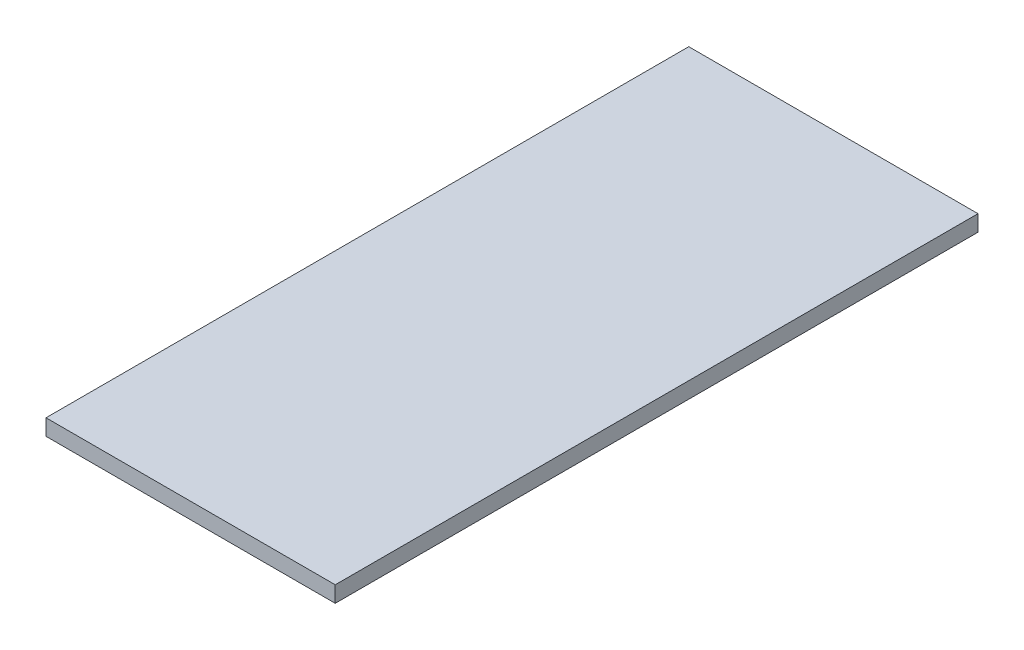
ISO-10303-21;
HEADER;
FILE_DESCRIPTION(('STEP AP214'),'2;1');
FILE_NAME('part.step','',(''),(''),'','','');
FILE_SCHEMA(('AUTOMOTIVE_DESIGN { 1 0 10303 214 1 1 1 1 }'));
ENDSEC;
DATA;
#1=APPLICATION_CONTEXT('core data for automotive mechanical design processes');
#2=APPLICATION_PROTOCOL_DEFINITION('international standard','automotive_design',2000,#1);
#3=PRODUCT_CONTEXT('',#1,'mechanical');
#4=PRODUCT('Part','Part','',(#3));
#5=PRODUCT_RELATED_PRODUCT_CATEGORY('part','',(#4));
#6=PRODUCT_DEFINITION_FORMATION('','',#4);
#7=PRODUCT_DEFINITION_CONTEXT('part definition',#1,'design');
#8=PRODUCT_DEFINITION('design','',#6,#7);
#9=PRODUCT_DEFINITION_SHAPE('','',#8);
#10=(LENGTH_UNIT() NAMED_UNIT(*) SI_UNIT(.MILLI.,.METRE.));
#11=(NAMED_UNIT(*) PLANE_ANGLE_UNIT() SI_UNIT($,.RADIAN.));
#12=(NAMED_UNIT(*) SI_UNIT($,.STERADIAN.) SOLID_ANGLE_UNIT());
#13=UNCERTAINTY_MEASURE_WITH_UNIT(LENGTH_MEASURE(1.E-05),#10,'distance_accuracy_value','');
#14=(GEOMETRIC_REPRESENTATION_CONTEXT(3) GLOBAL_UNCERTAINTY_ASSIGNED_CONTEXT((#13)) GLOBAL_UNIT_ASSIGNED_CONTEXT((#10,
#11,#12)) REPRESENTATION_CONTEXT('',''));
#15=CARTESIAN_POINT('',(0.,0.,0.));
#16=DIRECTION('',(0.,0.,1.));
#17=DIRECTION('',(1.,0.,0.));
#18=AXIS2_PLACEMENT_3D('',#15,#16,#17);
#19=CARTESIAN_POINT('',(-13.5,1.5,30.));
#20=DIRECTION('',(1.,0.,0.));
#21=DIRECTION('',(0.,0.,-1.));
#22=AXIS2_PLACEMENT_3D('',#19,#20,#21);
#23=PLANE('',#22);
#24=DIRECTION('',(0.,0.,1.));
#25=VECTOR('',#24,1.);
#26=CARTESIAN_POINT('',(-13.5,0.,30.));
#27=LINE('',#26,#25);
#28=CARTESIAN_POINT('',(-13.5,0.,-30.));
#29=VERTEX_POINT('',#28);
#30=CARTESIAN_POINT('',(-13.5,0.,30.));
#31=VERTEX_POINT('',#30);
#32=EDGE_CURVE('E116',#29,#31,#27,.T.);
#33=ORIENTED_EDGE('',*,*,#32,.T.);
#34=DIRECTION('',(0.,-1.,0.));
#35=VECTOR('',#34,1.);
#36=CARTESIAN_POINT('',(-13.5,1.5,30.));
#37=LINE('',#36,#35);
#38=CARTESIAN_POINT('',(-13.5,1.5,30.));
#39=VERTEX_POINT('',#38);
#40=EDGE_CURVE('E12',#39,#31,#37,.T.);
#41=ORIENTED_EDGE('',*,*,#40,.F.);
#42=DIRECTION('',(0.,0.,1.));
#43=VECTOR('',#42,1.);
#44=CARTESIAN_POINT('',(-13.5,1.5,30.));
#45=LINE('',#44,#43);
#46=CARTESIAN_POINT('',(-13.5,1.5,-30.));
#47=VERTEX_POINT('',#46);
#48=EDGE_CURVE('E103',#47,#39,#45,.T.);
#49=ORIENTED_EDGE('',*,*,#48,.F.);
#50=DIRECTION('',(0.,-1.,0.));
#51=VECTOR('',#50,1.);
#52=CARTESIAN_POINT('',(-13.5,1.5,-30.));
#53=LINE('',#52,#51);
#54=EDGE_CURVE('E111',#47,#29,#53,.T.);
#55=ORIENTED_EDGE('',*,*,#54,.T.);
#56=EDGE_LOOP('',(#33,#41,#49,#55));
#57=FACE_BOUND('',#56,.T.);
#58=ADVANCED_FACE('F52',(#57),#23,.F.);
#59=CARTESIAN_POINT('',(13.5,1.5,30.));
#60=DIRECTION('',(0.,0.,-1.));
#61=DIRECTION('',(-1.,0.,0.));
#62=AXIS2_PLACEMENT_3D('',#59,#60,#61);
#63=PLANE('',#62);
#64=DIRECTION('',(1.,0.,0.));
#65=VECTOR('',#64,1.);
#66=CARTESIAN_POINT('',(13.5,0.,30.));
#67=LINE('',#66,#65);
#68=CARTESIAN_POINT('',(13.5,0.,30.));
#69=VERTEX_POINT('',#68);
#70=EDGE_CURVE('E107',#31,#69,#67,.T.);
#71=ORIENTED_EDGE('',*,*,#70,.T.);
#72=DIRECTION('',(0.,-1.,0.));
#73=VECTOR('',#72,1.);
#74=CARTESIAN_POINT('',(13.5,1.5,30.));
#75=LINE('',#74,#73);
#76=CARTESIAN_POINT('',(13.5,1.5,30.));
#77=VERTEX_POINT('',#76);
#78=EDGE_CURVE('E60',#77,#69,#75,.T.);
#79=ORIENTED_EDGE('',*,*,#78,.F.);
#80=DIRECTION('',(1.,0.,0.));
#81=VECTOR('',#80,1.);
#82=CARTESIAN_POINT('',(13.5,1.5,30.));
#83=LINE('',#82,#81);
#84=EDGE_CURVE('E98',#39,#77,#83,.T.);
#85=ORIENTED_EDGE('',*,*,#84,.F.);
#86=ORIENTED_EDGE('',*,*,#40,.T.);
#87=EDGE_LOOP('',(#71,#79,#85,#86));
#88=FACE_BOUND('',#87,.T.);
#89=ADVANCED_FACE('F106',(#88),#63,.F.);
#90=CARTESIAN_POINT('',(13.5,1.5,30.));
#91=DIRECTION('',(-1.,0.,0.));
#92=DIRECTION('',(0.,0.,1.));
#93=AXIS2_PLACEMENT_3D('',#90,#91,#92);
#94=PLANE('',#93);
#95=DIRECTION('',(0.,0.,-1.));
#96=VECTOR('',#95,1.);
#97=CARTESIAN_POINT('',(13.5,0.,30.));
#98=LINE('',#97,#96);
#99=CARTESIAN_POINT('',(13.5,0.,-30.));
#100=VERTEX_POINT('',#99);
#101=EDGE_CURVE('E85',#69,#100,#98,.T.);
#102=ORIENTED_EDGE('',*,*,#101,.T.);
#103=DIRECTION('',(0.,-1.,0.));
#104=VECTOR('',#103,1.);
#105=CARTESIAN_POINT('',(13.5,1.5,-30.));
#106=LINE('',#105,#104);
#107=CARTESIAN_POINT('',(13.5,1.5,-30.));
#108=VERTEX_POINT('',#107);
#109=EDGE_CURVE('E108',#108,#100,#106,.T.);
#110=ORIENTED_EDGE('',*,*,#109,.F.);
#111=DIRECTION('',(0.,0.,-1.));
#112=VECTOR('',#111,1.);
#113=CARTESIAN_POINT('',(13.5,1.5,30.));
#114=LINE('',#113,#112);
#115=EDGE_CURVE('E101',#77,#108,#114,.T.);
#116=ORIENTED_EDGE('',*,*,#115,.F.);
#117=ORIENTED_EDGE('',*,*,#78,.T.);
#118=EDGE_LOOP('',(#102,#110,#116,#117));
#119=FACE_BOUND('',#118,.T.);
#120=ADVANCED_FACE('F109',(#119),#94,.F.);
#121=CARTESIAN_POINT('',(13.5,1.5,-30.));
#122=DIRECTION('',(0.,0.,1.));
#123=DIRECTION('',(1.,0.,0.));
#124=AXIS2_PLACEMENT_3D('',#121,#122,#123);
#125=PLANE('',#124);
#126=DIRECTION('',(-1.,0.,0.));
#127=VECTOR('',#126,1.);
#128=CARTESIAN_POINT('',(13.5,0.,-30.));
#129=LINE('',#128,#127);
#130=EDGE_CURVE('E91',#100,#29,#129,.T.);
#131=ORIENTED_EDGE('',*,*,#130,.T.);
#132=ORIENTED_EDGE('',*,*,#54,.F.);
#133=DIRECTION('',(-1.,0.,0.));
#134=VECTOR('',#133,1.);
#135=CARTESIAN_POINT('',(13.5,1.5,-30.));
#136=LINE('',#135,#134);
#137=EDGE_CURVE('E68',#108,#47,#136,.T.);
#138=ORIENTED_EDGE('',*,*,#137,.F.);
#139=ORIENTED_EDGE('',*,*,#109,.T.);
#140=EDGE_LOOP('',(#131,#132,#138,#139));
#141=FACE_BOUND('',#140,.T.);
#142=ADVANCED_FACE('F125',(#141),#125,.F.);
#143=CARTESIAN_POINT('',(0.,1.5,0.));
#144=DIRECTION('',(0.,1.,0.));
#145=DIRECTION('',(0.,0.,1.));
#146=AXIS2_PLACEMENT_3D('',#143,#144,#145);
#147=PLANE('',#146);
#148=ORIENTED_EDGE('',*,*,#48,.T.);
#149=ORIENTED_EDGE('',*,*,#84,.T.);
#150=ORIENTED_EDGE('',*,*,#115,.T.);
#151=ORIENTED_EDGE('',*,*,#137,.T.);
#152=EDGE_LOOP('',(#148,#149,#150,#151));
#153=FACE_BOUND('',#152,.T.);
#154=ADVANCED_FACE('F99',(#153),#147,.T.);
#155=CARTESIAN_POINT('',(0.,0.,0.));
#156=DIRECTION('',(0.,1.,0.));
#157=DIRECTION('',(0.,0.,1.));
#158=AXIS2_PLACEMENT_3D('',#155,#156,#157);
#159=PLANE('',#158);
#160=ORIENTED_EDGE('',*,*,#32,.F.);
#161=ORIENTED_EDGE('',*,*,#130,.F.);
#162=ORIENTED_EDGE('',*,*,#101,.F.);
#163=ORIENTED_EDGE('',*,*,#70,.F.);
#164=EDGE_LOOP('',(#160,#161,#162,#163));
#165=FACE_BOUND('',#164,.T.);
#166=ADVANCED_FACE('F128',(#165),#159,.F.);
#167=CLOSED_SHELL('',(#58,#89,#120,#142,#154,#166));
#168=MANIFOLD_SOLID_BREP('B2',#167);
#169=ADVANCED_BREP_SHAPE_REPRESENTATION('',(#18,#168),#14);
#170=SHAPE_DEFINITION_REPRESENTATION(#9,#169);
ENDSEC;
END-ISO-10303-21;
